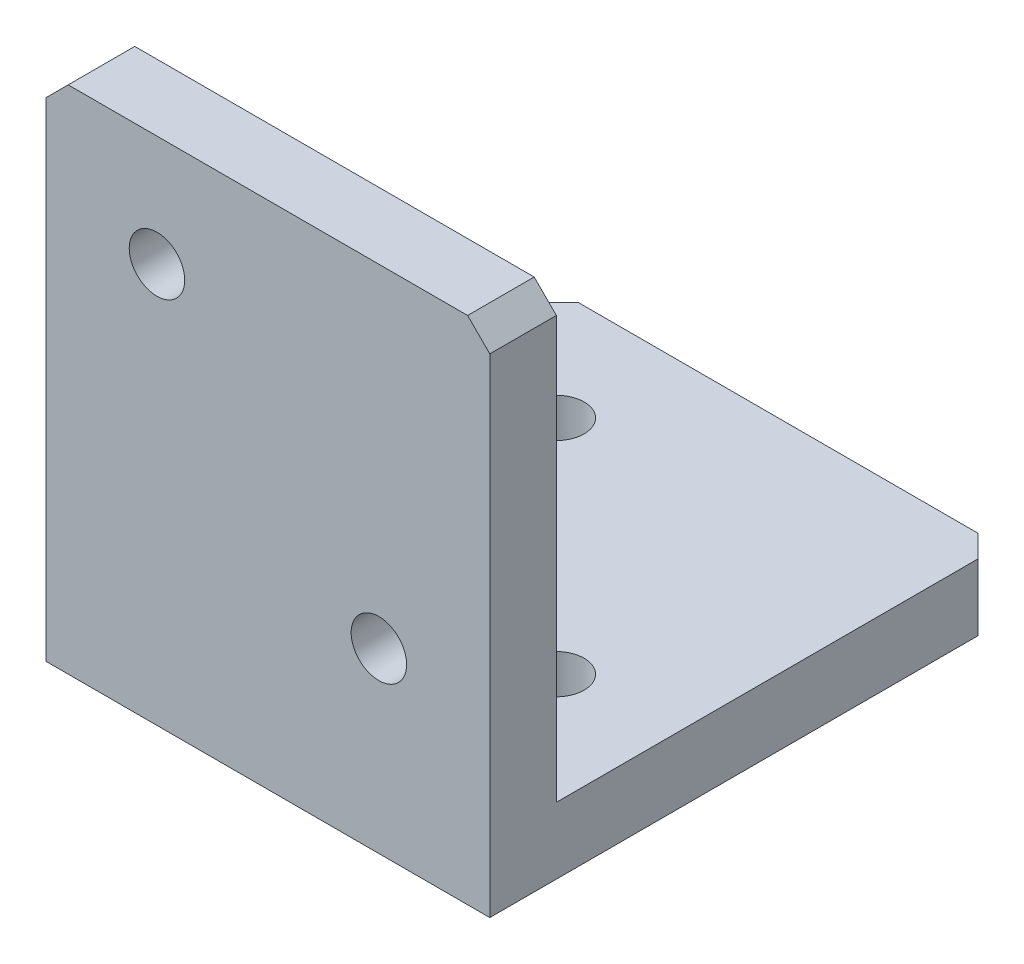
ISO-10303-21;
HEADER;
FILE_DESCRIPTION(('STEP AP214'),'2;1');
FILE_NAME('part.step','',(''),(''),'','','');
FILE_SCHEMA(('AUTOMOTIVE_DESIGN { 1 0 10303 214 1 1 1 1 }'));
ENDSEC;
DATA;
#1=APPLICATION_CONTEXT('core data for automotive mechanical design processes');
#2=APPLICATION_PROTOCOL_DEFINITION('international standard','automotive_design',2000,#1);
#3=PRODUCT_CONTEXT('',#1,'mechanical');
#4=PRODUCT('Part','Part','',(#3));
#5=PRODUCT_RELATED_PRODUCT_CATEGORY('part','',(#4));
#6=PRODUCT_DEFINITION_FORMATION('','',#4);
#7=PRODUCT_DEFINITION_CONTEXT('part definition',#1,'design');
#8=PRODUCT_DEFINITION('design','',#6,#7);
#9=PRODUCT_DEFINITION_SHAPE('','',#8);
#10=(LENGTH_UNIT() NAMED_UNIT(*) SI_UNIT(.MILLI.,.METRE.));
#11=(NAMED_UNIT(*) PLANE_ANGLE_UNIT() SI_UNIT($,.RADIAN.));
#12=(NAMED_UNIT(*) SI_UNIT($,.STERADIAN.) SOLID_ANGLE_UNIT());
#13=UNCERTAINTY_MEASURE_WITH_UNIT(LENGTH_MEASURE(1.E-05),#10,'distance_accuracy_value','');
#14=(GEOMETRIC_REPRESENTATION_CONTEXT(3) GLOBAL_UNCERTAINTY_ASSIGNED_CONTEXT((#13)) GLOBAL_UNIT_ASSIGNED_CONTEXT((#10,
#11,#12)) REPRESENTATION_CONTEXT('',''));
#15=CARTESIAN_POINT('',(0.,0.,0.));
#16=DIRECTION('',(0.,0.,1.));
#17=DIRECTION('',(1.,0.,0.));
#18=AXIS2_PLACEMENT_3D('',#15,#16,#17);
#19=CARTESIAN_POINT('',(-10.,-10.,3.));
#20=DIRECTION('',(1.,0.,0.));
#21=DIRECTION('',(0.,0.,-1.));
#22=AXIS2_PLACEMENT_3D('',#19,#20,#21);
#23=PLANE('',#22);
#24=DIRECTION('',(0.,0.,1.));
#25=VECTOR('',#24,1.);
#26=CARTESIAN_POINT('',(-10.,-10.,-20.));
#27=LINE('',#26,#25);
#28=CARTESIAN_POINT('',(-10.,-10.,-19.));
#29=VERTEX_POINT('',#28);
#30=CARTESIAN_POINT('',(-10.,-10.,0.));
#31=VERTEX_POINT('',#30);
#32=EDGE_CURVE('E152',#29,#31,#27,.T.);
#33=ORIENTED_EDGE('',*,*,#32,.F.);
#34=DIRECTION('',(0.,-1.,0.));
#35=VECTOR('',#34,1.);
#36=CARTESIAN_POINT('',(-10.,-10.,-19.));
#37=LINE('',#36,#35);
#38=CARTESIAN_POINT('',(-10.,-13.,-19.));
#39=VERTEX_POINT('',#38);
#40=EDGE_CURVE('E132',#29,#39,#37,.T.);
#41=ORIENTED_EDGE('',*,*,#40,.T.);
#42=DIRECTION('',(0.,0.,1.));
#43=VECTOR('',#42,1.);
#44=CARTESIAN_POINT('',(-10.,-13.,-20.));
#45=LINE('',#44,#43);
#46=CARTESIAN_POINT('',(-10.,-13.,3.));
#47=VERTEX_POINT('',#46);
#48=EDGE_CURVE('E129',#39,#47,#45,.T.);
#49=ORIENTED_EDGE('',*,*,#48,.T.);
#50=DIRECTION('',(0.,-1.,0.));
#51=VECTOR('',#50,1.);
#52=CARTESIAN_POINT('',(-10.,-10.,3.));
#53=LINE('',#52,#51);
#54=CARTESIAN_POINT('',(-10.,8.99999999999999,3.));
#55=VERTEX_POINT('',#54);
#56=EDGE_CURVE('E114',#55,#47,#53,.T.);
#57=ORIENTED_EDGE('',*,*,#56,.F.);
#58=DIRECTION('',(0.,0.,-1.));
#59=VECTOR('',#58,1.);
#60=CARTESIAN_POINT('',(-10.,8.99999999999999,3.));
#61=LINE('',#60,#59);
#62=CARTESIAN_POINT('',(-10.,8.99999999999999,0.));
#63=VERTEX_POINT('',#62);
#64=EDGE_CURVE('E165',#55,#63,#61,.T.);
#65=ORIENTED_EDGE('',*,*,#64,.T.);
#66=DIRECTION('',(0.,-1.,0.));
#67=VECTOR('',#66,1.);
#68=CARTESIAN_POINT('',(-10.,-10.,0.));
#69=LINE('',#68,#67);
#70=EDGE_CURVE('E155',#63,#31,#69,.T.);
#71=ORIENTED_EDGE('',*,*,#70,.T.);
#72=EDGE_LOOP('',(#33,#41,#49,#57,#65,#71));
#73=FACE_BOUND('',#72,.T.);
#74=ADVANCED_FACE('F38',(#73),#23,.F.);
#75=CARTESIAN_POINT('',(10.,-10.,3.));
#76=DIRECTION('',(-1.,0.,0.));
#77=DIRECTION('',(0.,0.,1.));
#78=AXIS2_PLACEMENT_3D('',#75,#76,#77);
#79=PLANE('',#78);
#80=DIRECTION('',(0.,0.,1.));
#81=VECTOR('',#80,1.);
#82=CARTESIAN_POINT('',(10.,-13.,-20.));
#83=LINE('',#82,#81);
#84=CARTESIAN_POINT('',(10.,-13.,-19.));
#85=VERTEX_POINT('',#84);
#86=CARTESIAN_POINT('',(10.,-13.,3.));
#87=VERTEX_POINT('',#86);
#88=EDGE_CURVE('E135',#85,#87,#83,.T.);
#89=ORIENTED_EDGE('',*,*,#88,.F.);
#90=DIRECTION('',(0.,1.,0.));
#91=VECTOR('',#90,1.);
#92=CARTESIAN_POINT('',(10.,-10.,-19.));
#93=LINE('',#92,#91);
#94=CARTESIAN_POINT('',(10.,-10.,-19.));
#95=VERTEX_POINT('',#94);
#96=EDGE_CURVE('E204',#85,#95,#93,.T.);
#97=ORIENTED_EDGE('',*,*,#96,.T.);
#98=DIRECTION('',(0.,0.,1.));
#99=VECTOR('',#98,1.);
#100=CARTESIAN_POINT('',(10.,-10.,-20.));
#101=LINE('',#100,#99);
#102=CARTESIAN_POINT('',(10.,-10.,0.));
#103=VERTEX_POINT('',#102);
#104=EDGE_CURVE('E156',#95,#103,#101,.T.);
#105=ORIENTED_EDGE('',*,*,#104,.T.);
#106=DIRECTION('',(0.,1.,0.));
#107=VECTOR('',#106,1.);
#108=CARTESIAN_POINT('',(10.,-10.,0.));
#109=LINE('',#108,#107);
#110=CARTESIAN_POINT('',(10.,8.99999999999999,0.));
#111=VERTEX_POINT('',#110);
#112=EDGE_CURVE('E172',#103,#111,#109,.T.);
#113=ORIENTED_EDGE('',*,*,#112,.T.);
#114=DIRECTION('',(0.,0.,1.));
#115=VECTOR('',#114,1.);
#116=CARTESIAN_POINT('',(10.,8.99999999999999,3.));
#117=LINE('',#116,#115);
#118=CARTESIAN_POINT('',(10.,8.99999999999999,3.));
#119=VERTEX_POINT('',#118);
#120=EDGE_CURVE('E202',#111,#119,#117,.T.);
#121=ORIENTED_EDGE('',*,*,#120,.T.);
#122=DIRECTION('',(0.,1.,0.));
#123=VECTOR('',#122,1.);
#124=CARTESIAN_POINT('',(10.,-10.,3.));
#125=LINE('',#124,#123);
#126=EDGE_CURVE('E124',#87,#119,#125,.T.);
#127=ORIENTED_EDGE('',*,*,#126,.F.);
#128=EDGE_LOOP('',(#89,#97,#105,#113,#121,#127));
#129=FACE_BOUND('',#128,.T.);
#130=ADVANCED_FACE('F243',(#129),#79,.F.);
#131=CARTESIAN_POINT('',(10.,10.,3.));
#132=DIRECTION('',(0.,-1.,0.));
#133=DIRECTION('',(1.,0.,0.));
#134=AXIS2_PLACEMENT_3D('',#131,#132,#133);
#135=PLANE('',#134);
#136=DIRECTION('',(-1.,0.,0.));
#137=VECTOR('',#136,1.);
#138=CARTESIAN_POINT('',(10.,10.,0.));
#139=LINE('',#138,#137);
#140=CARTESIAN_POINT('',(8.99999999999999,10.,0.));
#141=VERTEX_POINT('',#140);
#142=CARTESIAN_POINT('',(-8.99999999999999,10.,0.));
#143=VERTEX_POINT('',#142);
#144=EDGE_CURVE('E125',#141,#143,#139,.T.);
#145=ORIENTED_EDGE('',*,*,#144,.T.);
#146=DIRECTION('',(0.,0.,1.));
#147=VECTOR('',#146,1.);
#148=CARTESIAN_POINT('',(-8.99999999999999,10.,3.));
#149=LINE('',#148,#147);
#150=CARTESIAN_POINT('',(-8.99999999999999,10.,3.));
#151=VERTEX_POINT('',#150);
#152=EDGE_CURVE('E53',#143,#151,#149,.T.);
#153=ORIENTED_EDGE('',*,*,#152,.T.);
#154=DIRECTION('',(-1.,0.,0.));
#155=VECTOR('',#154,1.);
#156=CARTESIAN_POINT('',(10.,10.,3.));
#157=LINE('',#156,#155);
#158=CARTESIAN_POINT('',(8.99999999999999,10.,3.));
#159=VERTEX_POINT('',#158);
#160=EDGE_CURVE('E162',#159,#151,#157,.T.);
#161=ORIENTED_EDGE('',*,*,#160,.F.);
#162=DIRECTION('',(0.,0.,-1.));
#163=VECTOR('',#162,1.);
#164=CARTESIAN_POINT('',(8.99999999999999,10.,3.));
#165=LINE('',#164,#163);
#166=EDGE_CURVE('E211',#159,#141,#165,.T.);
#167=ORIENTED_EDGE('',*,*,#166,.T.);
#168=EDGE_LOOP('',(#145,#153,#161,#167));
#169=FACE_BOUND('',#168,.T.);
#170=ADVANCED_FACE('F216',(#169),#135,.F.);
#171=CARTESIAN_POINT('',(0.,0.,3.));
#172=DIRECTION('',(0.,0.,1.));
#173=DIRECTION('',(1.,0.,0.));
#174=AXIS2_PLACEMENT_3D('',#171,#172,#173);
#175=PLANE('',#174);
#176=CARTESIAN_POINT('',(-5.,5.,3.));
#177=DIRECTION('',(0.,0.,1.));
#178=DIRECTION('',(1.,0.,0.));
#179=AXIS2_PLACEMENT_3D('',#176,#177,#178);
#180=CIRCLE('',#179,1.24999999999999);
#181=CARTESIAN_POINT('',(-3.75000000000001,5.,3.));
#182=VERTEX_POINT('',#181);
#183=EDGE_CURVE('E422',#182,#182,#180,.T.);
#184=ORIENTED_EDGE('',*,*,#183,.F.);
#185=EDGE_LOOP('',(#184));
#186=FACE_BOUND('',#185,.T.);
#187=CARTESIAN_POINT('',(5.,-5.,3.));
#188=DIRECTION('',(0.,0.,1.));
#189=DIRECTION('',(1.,0.,0.));
#190=AXIS2_PLACEMENT_3D('',#187,#188,#189);
#191=CIRCLE('',#190,1.24999999999999);
#192=CARTESIAN_POINT('',(6.24999999999999,-5.,3.));
#193=VERTEX_POINT('',#192);
#194=EDGE_CURVE('E142',#193,#193,#191,.T.);
#195=ORIENTED_EDGE('',*,*,#194,.F.);
#196=EDGE_LOOP('',(#195));
#197=FACE_BOUND('',#196,.T.);
#198=ORIENTED_EDGE('',*,*,#160,.T.);
#199=DIRECTION('',(0.707106781186548,0.707106781186548,0.));
#200=VECTOR('',#199,1.);
#201=CARTESIAN_POINT('',(-9.49999999999999,9.49999999999999,3.));
#202=LINE('',#201,#200);
#203=EDGE_CURVE('E11',#151,#55,#202,.F.);
#204=ORIENTED_EDGE('',*,*,#203,.T.);
#205=ORIENTED_EDGE('',*,*,#56,.T.);
#206=DIRECTION('',(1.,0.,0.));
#207=VECTOR('',#206,1.);
#208=CARTESIAN_POINT('',(-10.,-13.,3.));
#209=LINE('',#208,#207);
#210=EDGE_CURVE('E118',#47,#87,#209,.T.);
#211=ORIENTED_EDGE('',*,*,#210,.T.);
#212=ORIENTED_EDGE('',*,*,#126,.T.);
#213=DIRECTION('',(0.707106781186548,-0.707106781186548,0.));
#214=VECTOR('',#213,1.);
#215=CARTESIAN_POINT('',(9.49999999999999,9.49999999999999,3.));
#216=LINE('',#215,#214);
#217=EDGE_CURVE('E46',#119,#159,#216,.F.);
#218=ORIENTED_EDGE('',*,*,#217,.T.);
#219=EDGE_LOOP('',(#198,#204,#205,#211,#212,#218));
#220=FACE_BOUND('',#219,.T.);
#221=ADVANCED_FACE('F116',(#186,#197,#220),#175,.T.);
#222=CARTESIAN_POINT('',(0.,0.,0.));
#223=DIRECTION('',(0.,0.,1.));
#224=DIRECTION('',(1.,0.,0.));
#225=AXIS2_PLACEMENT_3D('',#222,#223,#224);
#226=PLANE('',#225);
#227=CARTESIAN_POINT('',(-5.,5.,0.));
#228=DIRECTION('',(0.,0.,-1.));
#229=DIRECTION('',(-1.,0.,0.));
#230=AXIS2_PLACEMENT_3D('',#227,#228,#229);
#231=CIRCLE('',#230,1.24999999999999);
#232=CARTESIAN_POINT('',(-6.24999999999999,5.,0.));
#233=VERTEX_POINT('',#232);
#234=EDGE_CURVE('E182',#233,#233,#231,.T.);
#235=ORIENTED_EDGE('',*,*,#234,.F.);
#236=EDGE_LOOP('',(#235));
#237=FACE_BOUND('',#236,.T.);
#238=CARTESIAN_POINT('',(5.,-5.,0.));
#239=DIRECTION('',(0.,0.,-1.));
#240=DIRECTION('',(-1.,0.,0.));
#241=AXIS2_PLACEMENT_3D('',#238,#239,#240);
#242=CIRCLE('',#241,1.24999999999999);
#243=CARTESIAN_POINT('',(3.75000000000001,-5.,0.));
#244=VERTEX_POINT('',#243);
#245=EDGE_CURVE('E148',#244,#244,#242,.T.);
#246=ORIENTED_EDGE('',*,*,#245,.F.);
#247=EDGE_LOOP('',(#246));
#248=FACE_BOUND('',#247,.T.);
#249=ORIENTED_EDGE('',*,*,#70,.F.);
#250=DIRECTION('',(-0.707106781186548,-0.707106781186548,0.));
#251=VECTOR('',#250,1.);
#252=CARTESIAN_POINT('',(-10.,8.99999999999999,0.));
#253=LINE('',#252,#251);
#254=EDGE_CURVE('E209',#63,#143,#253,.F.);
#255=ORIENTED_EDGE('',*,*,#254,.T.);
#256=ORIENTED_EDGE('',*,*,#144,.F.);
#257=DIRECTION('',(-0.707106781186548,0.707106781186548,0.));
#258=VECTOR('',#257,1.);
#259=CARTESIAN_POINT('',(8.99999999999999,10.,0.));
#260=LINE('',#259,#258);
#261=EDGE_CURVE('E207',#141,#111,#260,.F.);
#262=ORIENTED_EDGE('',*,*,#261,.T.);
#263=ORIENTED_EDGE('',*,*,#112,.F.);
#264=DIRECTION('',(1.,0.,0.));
#265=VECTOR('',#264,1.);
#266=CARTESIAN_POINT('',(10.,-10.,0.));
#267=LINE('',#266,#265);
#268=EDGE_CURVE('E169',#31,#103,#267,.T.);
#269=ORIENTED_EDGE('',*,*,#268,.F.);
#270=EDGE_LOOP('',(#249,#255,#256,#262,#263,#269));
#271=FACE_BOUND('',#270,.T.);
#272=ADVANCED_FACE('F220',(#237,#248,#271),#226,.F.);
#273=CARTESIAN_POINT('',(-10.,-10.,-20.));
#274=DIRECTION('',(0.,1.,0.));
#275=DIRECTION('',(0.,0.,1.));
#276=AXIS2_PLACEMENT_3D('',#273,#274,#275);
#277=PLANE('',#276);
#278=CARTESIAN_POINT('',(-5.,-10.,-15.));
#279=DIRECTION('',(0.,1.,0.));
#280=DIRECTION('',(0.,0.,1.));
#281=AXIS2_PLACEMENT_3D('',#278,#279,#280);
#282=CIRCLE('',#281,1.24999999999999);
#283=CARTESIAN_POINT('',(-5.,-10.,-13.75));
#284=VERTEX_POINT('',#283);
#285=EDGE_CURVE('E187',#284,#284,#282,.T.);
#286=ORIENTED_EDGE('',*,*,#285,.F.);
#287=EDGE_LOOP('',(#286));
#288=FACE_BOUND('',#287,.T.);
#289=CARTESIAN_POINT('',(5.,-10.,-5.));
#290=DIRECTION('',(0.,1.,0.));
#291=DIRECTION('',(0.,0.,1.));
#292=AXIS2_PLACEMENT_3D('',#289,#290,#291);
#293=CIRCLE('',#292,1.24999999999999);
#294=CARTESIAN_POINT('',(5.,-10.,-3.75000000000001));
#295=VERTEX_POINT('',#294);
#296=EDGE_CURVE('E183',#295,#295,#293,.T.);
#297=ORIENTED_EDGE('',*,*,#296,.F.);
#298=EDGE_LOOP('',(#297));
#299=FACE_BOUND('',#298,.T.);
#300=DIRECTION('',(-1.,0.,0.));
#301=VECTOR('',#300,1.);
#302=CARTESIAN_POINT('',(-10.,-10.,-20.));
#303=LINE('',#302,#301);
#304=CARTESIAN_POINT('',(9.,-10.,-20.));
#305=VERTEX_POINT('',#304);
#306=CARTESIAN_POINT('',(-9.,-10.,-20.));
#307=VERTEX_POINT('',#306);
#308=EDGE_CURVE('E136',#305,#307,#303,.T.);
#309=ORIENTED_EDGE('',*,*,#308,.T.);
#310=DIRECTION('',(0.707106781186548,0.,-0.707106781186548));
#311=VECTOR('',#310,1.);
#312=CARTESIAN_POINT('',(-9.5,-10.,-19.5));
#313=LINE('',#312,#311);
#314=EDGE_CURVE('E200',#307,#29,#313,.F.);
#315=ORIENTED_EDGE('',*,*,#314,.T.);
#316=ORIENTED_EDGE('',*,*,#32,.T.);
#317=ORIENTED_EDGE('',*,*,#268,.T.);
#318=ORIENTED_EDGE('',*,*,#104,.F.);
#319=DIRECTION('',(0.707106781186548,0.,0.707106781186548));
#320=VECTOR('',#319,1.);
#321=CARTESIAN_POINT('',(-0.500000000000004,-10.,-29.5));
#322=LINE('',#321,#320);
#323=EDGE_CURVE('E198',#95,#305,#322,.F.);
#324=ORIENTED_EDGE('',*,*,#323,.T.);
#325=EDGE_LOOP('',(#309,#315,#316,#317,#318,#324));
#326=FACE_BOUND('',#325,.T.);
#327=ADVANCED_FACE('F228',(#288,#299,#326),#277,.T.);
#328=CARTESIAN_POINT('',(-10.,-13.,-20.));
#329=DIRECTION('',(0.,-1.,0.));
#330=DIRECTION('',(0.,0.,-1.));
#331=AXIS2_PLACEMENT_3D('',#328,#329,#330);
#332=PLANE('',#331);
#333=CARTESIAN_POINT('',(-5.,-13.,-15.));
#334=DIRECTION('',(0.,-1.,0.));
#335=DIRECTION('',(0.,0.,-1.));
#336=AXIS2_PLACEMENT_3D('',#333,#334,#335);
#337=CIRCLE('',#336,1.24999999999999);
#338=CARTESIAN_POINT('',(-5.,-13.,-16.25));
#339=VERTEX_POINT('',#338);
#340=EDGE_CURVE('E184',#339,#339,#337,.T.);
#341=ORIENTED_EDGE('',*,*,#340,.F.);
#342=EDGE_LOOP('',(#341));
#343=FACE_BOUND('',#342,.T.);
#344=CARTESIAN_POINT('',(5.,-13.,-5.));
#345=DIRECTION('',(0.,-1.,0.));
#346=DIRECTION('',(0.,0.,-1.));
#347=AXIS2_PLACEMENT_3D('',#344,#345,#346);
#348=CIRCLE('',#347,1.24999999999999);
#349=CARTESIAN_POINT('',(5.,-13.,-6.24999999999999));
#350=VERTEX_POINT('',#349);
#351=EDGE_CURVE('E178',#350,#350,#348,.T.);
#352=ORIENTED_EDGE('',*,*,#351,.F.);
#353=EDGE_LOOP('',(#352));
#354=FACE_BOUND('',#353,.T.);
#355=ORIENTED_EDGE('',*,*,#48,.F.);
#356=DIRECTION('',(-0.707106781186548,0.,0.707106781186548));
#357=VECTOR('',#356,1.);
#358=CARTESIAN_POINT('',(-9.5,-13.,-19.5));
#359=LINE('',#358,#357);
#360=CARTESIAN_POINT('',(-9.,-13.,-20.));
#361=VERTEX_POINT('',#360);
#362=EDGE_CURVE('E192',#39,#361,#359,.F.);
#363=ORIENTED_EDGE('',*,*,#362,.T.);
#364=DIRECTION('',(1.,0.,0.));
#365=VECTOR('',#364,1.);
#366=CARTESIAN_POINT('',(-10.,-13.,-20.));
#367=LINE('',#366,#365);
#368=CARTESIAN_POINT('',(9.,-13.,-20.));
#369=VERTEX_POINT('',#368);
#370=EDGE_CURVE('E141',#361,#369,#367,.T.);
#371=ORIENTED_EDGE('',*,*,#370,.T.);
#372=DIRECTION('',(-0.707106781186548,0.,-0.707106781186548));
#373=VECTOR('',#372,1.);
#374=CARTESIAN_POINT('',(-0.500000000000004,-13.,-29.5));
#375=LINE('',#374,#373);
#376=EDGE_CURVE('E190',#369,#85,#375,.F.);
#377=ORIENTED_EDGE('',*,*,#376,.T.);
#378=ORIENTED_EDGE('',*,*,#88,.T.);
#379=ORIENTED_EDGE('',*,*,#210,.F.);
#380=EDGE_LOOP('',(#355,#363,#371,#377,#378,#379));
#381=FACE_BOUND('',#380,.T.);
#382=ADVANCED_FACE('F138',(#343,#354,#381),#332,.T.);
#383=CARTESIAN_POINT('',(0.,0.,-20.));
#384=DIRECTION('',(0.,0.,1.));
#385=DIRECTION('',(1.,0.,0.));
#386=AXIS2_PLACEMENT_3D('',#383,#384,#385);
#387=PLANE('',#386);
#388=ORIENTED_EDGE('',*,*,#370,.F.);
#389=DIRECTION('',(0.,1.,0.));
#390=VECTOR('',#389,1.);
#391=CARTESIAN_POINT('',(-9.,0.,-20.));
#392=LINE('',#391,#390);
#393=EDGE_CURVE('E196',#361,#307,#392,.T.);
#394=ORIENTED_EDGE('',*,*,#393,.T.);
#395=ORIENTED_EDGE('',*,*,#308,.F.);
#396=DIRECTION('',(0.,-1.,0.));
#397=VECTOR('',#396,1.);
#398=CARTESIAN_POINT('',(9.,0.,-20.));
#399=LINE('',#398,#397);
#400=EDGE_CURVE('E194',#305,#369,#399,.T.);
#401=ORIENTED_EDGE('',*,*,#400,.T.);
#402=EDGE_LOOP('',(#388,#394,#395,#401));
#403=FACE_BOUND('',#402,.T.);
#404=ADVANCED_FACE('F237',(#403),#387,.F.);
#405=CARTESIAN_POINT('',(5.,-5.,0.));
#406=DIRECTION('',(0.,0.,-1.));
#407=DIRECTION('',(-1.,0.,0.));
#408=AXIS2_PLACEMENT_3D('',#405,#406,#407);
#409=CYLINDRICAL_SURFACE('',#408,1.24999999999999);
#410=ORIENTED_EDGE('',*,*,#194,.T.);
#411=EDGE_LOOP('',(#410));
#412=FACE_BOUND('',#411,.T.);
#413=ORIENTED_EDGE('',*,*,#245,.T.);
#414=EDGE_LOOP('',(#413));
#415=FACE_BOUND('',#414,.T.);
#416=ADVANCED_FACE('F311',(#412,#415),#409,.F.);
#417=CARTESIAN_POINT('',(-5.,5.,0.));
#418=DIRECTION('',(0.,0.,-1.));
#419=DIRECTION('',(-1.,0.,0.));
#420=AXIS2_PLACEMENT_3D('',#417,#418,#419);
#421=CYLINDRICAL_SURFACE('',#420,1.24999999999999);
#422=ORIENTED_EDGE('',*,*,#183,.T.);
#423=EDGE_LOOP('',(#422));
#424=FACE_BOUND('',#423,.T.);
#425=ORIENTED_EDGE('',*,*,#234,.T.);
#426=EDGE_LOOP('',(#425));
#427=FACE_BOUND('',#426,.T.);
#428=ADVANCED_FACE('F301',(#424,#427),#421,.F.);
#429=CARTESIAN_POINT('',(5.,-10.,-5.));
#430=DIRECTION('',(0.,1.,0.));
#431=DIRECTION('',(0.,0.,1.));
#432=AXIS2_PLACEMENT_3D('',#429,#430,#431);
#433=CYLINDRICAL_SURFACE('',#432,1.24999999999999);
#434=ORIENTED_EDGE('',*,*,#351,.T.);
#435=EDGE_LOOP('',(#434));
#436=FACE_BOUND('',#435,.T.);
#437=ORIENTED_EDGE('',*,*,#296,.T.);
#438=EDGE_LOOP('',(#437));
#439=FACE_BOUND('',#438,.T.);
#440=ADVANCED_FACE('F290',(#436,#439),#433,.F.);
#441=CARTESIAN_POINT('',(-5.,-10.,-15.));
#442=DIRECTION('',(0.,1.,0.));
#443=DIRECTION('',(0.,0.,1.));
#444=AXIS2_PLACEMENT_3D('',#441,#442,#443);
#445=CYLINDRICAL_SURFACE('',#444,1.24999999999999);
#446=ORIENTED_EDGE('',*,*,#340,.T.);
#447=EDGE_LOOP('',(#446));
#448=FACE_BOUND('',#447,.T.);
#449=ORIENTED_EDGE('',*,*,#285,.T.);
#450=EDGE_LOOP('',(#449));
#451=FACE_BOUND('',#450,.T.);
#452=ADVANCED_FACE('F259',(#448,#451),#445,.F.);
#453=CARTESIAN_POINT('',(-10.,-10.,-19.));
#454=DIRECTION('',(0.707106781186547,0.,0.707106781186547));
#455=DIRECTION('',(0.,-1.,0.));
#456=AXIS2_PLACEMENT_3D('',#453,#454,#455);
#457=PLANE('',#456);
#458=ORIENTED_EDGE('',*,*,#314,.F.);
#459=ORIENTED_EDGE('',*,*,#393,.F.);
#460=ORIENTED_EDGE('',*,*,#362,.F.);
#461=ORIENTED_EDGE('',*,*,#40,.F.);
#462=EDGE_LOOP('',(#458,#459,#460,#461));
#463=FACE_BOUND('',#462,.T.);
#464=ADVANCED_FACE('F233',(#463),#457,.F.);
#465=CARTESIAN_POINT('',(10.,-10.,-19.));
#466=DIRECTION('',(-0.707106781186547,0.,0.707106781186547));
#467=DIRECTION('',(0.,1.,0.));
#468=AXIS2_PLACEMENT_3D('',#465,#466,#467);
#469=PLANE('',#468);
#470=ORIENTED_EDGE('',*,*,#376,.F.);
#471=ORIENTED_EDGE('',*,*,#400,.F.);
#472=ORIENTED_EDGE('',*,*,#323,.F.);
#473=ORIENTED_EDGE('',*,*,#96,.F.);
#474=EDGE_LOOP('',(#470,#471,#472,#473));
#475=FACE_BOUND('',#474,.T.);
#476=ADVANCED_FACE('F240',(#475),#469,.F.);
#477=CARTESIAN_POINT('',(-10.,8.99999999999999,3.));
#478=DIRECTION('',(0.707106781186547,-0.707106781186547,0.));
#479=DIRECTION('',(0.,0.,-1.));
#480=AXIS2_PLACEMENT_3D('',#477,#478,#479);
#481=PLANE('',#480);
#482=ORIENTED_EDGE('',*,*,#203,.F.);
#483=ORIENTED_EDGE('',*,*,#152,.F.);
#484=ORIENTED_EDGE('',*,*,#254,.F.);
#485=ORIENTED_EDGE('',*,*,#64,.F.);
#486=EDGE_LOOP('',(#482,#483,#484,#485));
#487=FACE_BOUND('',#486,.T.);
#488=ADVANCED_FACE('F224',(#487),#481,.F.);
#489=CARTESIAN_POINT('',(8.99999999999999,10.,3.));
#490=DIRECTION('',(-0.707106781186547,-0.707106781186547,0.));
#491=DIRECTION('',(0.,0.,-1.));
#492=AXIS2_PLACEMENT_3D('',#489,#490,#491);
#493=PLANE('',#492);
#494=ORIENTED_EDGE('',*,*,#217,.F.);
#495=ORIENTED_EDGE('',*,*,#120,.F.);
#496=ORIENTED_EDGE('',*,*,#261,.F.);
#497=ORIENTED_EDGE('',*,*,#166,.F.);
#498=EDGE_LOOP('',(#494,#495,#496,#497));
#499=FACE_BOUND('',#498,.T.);
#500=ADVANCED_FACE('F40',(#499),#493,.F.);
#501=CLOSED_SHELL('',(#74,#130,#170,#221,#272,#327,#382,#404,#416,#428,#440,#452,#464,#476,#488,#500));
#502=MANIFOLD_SOLID_BREP('B2',#501);
#503=ADVANCED_BREP_SHAPE_REPRESENTATION('',(#18,#502),#14);
#504=SHAPE_DEFINITION_REPRESENTATION(#9,#503);
ENDSEC;
END-ISO-10303-21;
